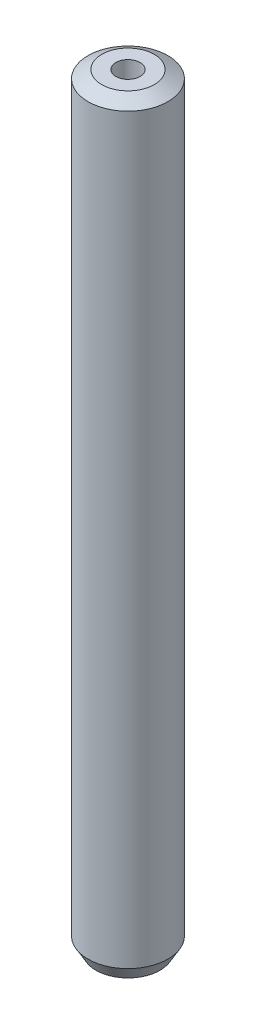
ISO-10303-21;
HEADER;
FILE_DESCRIPTION(('STEP AP214'),'2;1');
FILE_NAME('part.step','',(''),(''),'','','');
FILE_SCHEMA(('AUTOMOTIVE_DESIGN { 1 0 10303 214 1 1 1 1 }'));
ENDSEC;
DATA;
#1=APPLICATION_CONTEXT('core data for automotive mechanical design processes');
#2=APPLICATION_PROTOCOL_DEFINITION('international standard','automotive_design',2000,#1);
#3=PRODUCT_CONTEXT('',#1,'mechanical');
#4=PRODUCT('Part','Part','',(#3));
#5=PRODUCT_RELATED_PRODUCT_CATEGORY('part','',(#4));
#6=PRODUCT_DEFINITION_FORMATION('','',#4);
#7=PRODUCT_DEFINITION_CONTEXT('part definition',#1,'design');
#8=PRODUCT_DEFINITION('design','',#6,#7);
#9=PRODUCT_DEFINITION_SHAPE('','',#8);
#10=(LENGTH_UNIT() NAMED_UNIT(*) SI_UNIT(.MILLI.,.METRE.));
#11=(NAMED_UNIT(*) PLANE_ANGLE_UNIT() SI_UNIT($,.RADIAN.));
#12=(NAMED_UNIT(*) SI_UNIT($,.STERADIAN.) SOLID_ANGLE_UNIT());
#13=UNCERTAINTY_MEASURE_WITH_UNIT(LENGTH_MEASURE(1.E-05),#10,'distance_accuracy_value','');
#14=(GEOMETRIC_REPRESENTATION_CONTEXT(3) GLOBAL_UNCERTAINTY_ASSIGNED_CONTEXT((#13)) GLOBAL_UNIT_ASSIGNED_CONTEXT((#10,
#11,#12)) REPRESENTATION_CONTEXT('',''));
#15=CARTESIAN_POINT('',(0.,0.,0.));
#16=DIRECTION('',(0.,0.,1.));
#17=DIRECTION('',(1.,0.,0.));
#18=AXIS2_PLACEMENT_3D('',#15,#16,#17);
#19=CARTESIAN_POINT('',(0.,526.149621222578,0.));
#20=DIRECTION('',(0.,-1.,0.));
#21=DIRECTION('',(0.,0.,-1.));
#22=AXIS2_PLACEMENT_3D('',#19,#20,#21);
#23=CYLINDRICAL_SURFACE('',#22,27.5);
#24=CARTESIAN_POINT('',(0.,520.702828045299,0.));
#25=DIRECTION('',(0.,1.,0.));
#26=DIRECTION('',(0.,0.,1.));
#27=AXIS2_PLACEMENT_3D('',#24,#25,#26);
#28=CIRCLE('',#27,27.5);
#29=CARTESIAN_POINT('',(0.,520.702828045299,27.5));
#30=VERTEX_POINT('',#29);
#31=EDGE_CURVE('E50',#30,#30,#28,.F.);
#32=ORIENTED_EDGE('',*,*,#31,.T.);
#33=EDGE_LOOP('',(#32));
#34=FACE_BOUND('',#33,.T.);
#35=CARTESIAN_POINT('',(0.,9.43412252136611,0.));
#36=DIRECTION('',(0.,1.,0.));
#37=DIRECTION('',(0.,0.,1.));
#38=AXIS2_PLACEMENT_3D('',#35,#36,#37);
#39=CIRCLE('',#38,27.5);
#40=CARTESIAN_POINT('',(0.,9.43412252136611,27.5));
#41=VERTEX_POINT('',#40);
#42=EDGE_CURVE('E51',#41,#41,#39,.T.);
#43=ORIENTED_EDGE('',*,*,#42,.T.);
#44=EDGE_LOOP('',(#43));
#45=FACE_BOUND('',#44,.T.);
#46=ADVANCED_FACE('F39',(#34,#45),#23,.T.);
#47=CARTESIAN_POINT('',(0.,526.149621222578,0.));
#48=DIRECTION('',(0.,1.,0.));
#49=DIRECTION('',(0.,0.,1.));
#50=AXIS2_PLACEMENT_3D('',#47,#48,#49);
#51=PLANE('',#50);
#52=CARTESIAN_POINT('',(0.,526.149621222578,0.));
#53=DIRECTION('',(0.,1.,0.));
#54=DIRECTION('',(0.,0.,1.));
#55=AXIS2_PLACEMENT_3D('',#52,#53,#54);
#56=CIRCLE('',#55,18.0658774786337);
#57=CARTESIAN_POINT('',(0.,526.149621222578,18.0658774786337));
#58=VERTEX_POINT('',#57);
#59=EDGE_CURVE('E54',#58,#58,#56,.T.);
#60=ORIENTED_EDGE('',*,*,#59,.T.);
#61=EDGE_LOOP('',(#60));
#62=FACE_BOUND('',#61,.T.);
#63=CARTESIAN_POINT('',(0.,526.149621222578,0.));
#64=DIRECTION('',(0.,1.,0.));
#65=DIRECTION('',(0.,0.,1.));
#66=AXIS2_PLACEMENT_3D('',#63,#64,#65);
#67=CIRCLE('',#66,8.35634382573577);
#68=CARTESIAN_POINT('',(0.,526.149621222578,8.35634382573577));
#69=VERTEX_POINT('',#68);
#70=EDGE_CURVE('E58',#69,#69,#67,.T.);
#71=ORIENTED_EDGE('',*,*,#70,.F.);
#72=EDGE_LOOP('',(#71));
#73=FACE_BOUND('',#72,.T.);
#74=ADVANCED_FACE('F69',(#62,#73),#51,.T.);
#75=CARTESIAN_POINT('',(0.,0.,0.));
#76=DIRECTION('',(0.,1.,0.));
#77=DIRECTION('',(0.,0.,1.));
#78=AXIS2_PLACEMENT_3D('',#75,#76,#77);
#79=PLANE('',#78);
#80=CARTESIAN_POINT('',(0.,0.,0.));
#81=DIRECTION('',(0.,1.,0.));
#82=DIRECTION('',(0.,0.,1.));
#83=AXIS2_PLACEMENT_3D('',#80,#81,#82);
#84=CIRCLE('',#83,22.0532068227213);
#85=CARTESIAN_POINT('',(0.,0.,22.0532068227213));
#86=VERTEX_POINT('',#85);
#87=EDGE_CURVE('E10',#86,#86,#84,.F.);
#88=ORIENTED_EDGE('',*,*,#87,.T.);
#89=EDGE_LOOP('',(#88));
#90=FACE_BOUND('',#89,.T.);
#91=CARTESIAN_POINT('',(0.,0.,0.));
#92=DIRECTION('',(0.,1.,0.));
#93=DIRECTION('',(0.,0.,1.));
#94=AXIS2_PLACEMENT_3D('',#91,#92,#93);
#95=CIRCLE('',#94,8.35634382573577);
#96=CARTESIAN_POINT('',(0.,0.,8.35634382573577));
#97=VERTEX_POINT('',#96);
#98=EDGE_CURVE('E63',#97,#97,#95,.T.);
#99=ORIENTED_EDGE('',*,*,#98,.T.);
#100=EDGE_LOOP('',(#99));
#101=FACE_BOUND('',#100,.T.);
#102=ADVANCED_FACE('F75',(#90,#101),#79,.F.);
#103=CARTESIAN_POINT('',(0.,526.149621222578,0.));
#104=DIRECTION('',(0.,-1.,0.));
#105=DIRECTION('',(0.,0.,-1.));
#106=AXIS2_PLACEMENT_3D('',#103,#104,#105);
#107=CYLINDRICAL_SURFACE('',#106,8.35634382573577);
#108=ORIENTED_EDGE('',*,*,#70,.T.);
#109=EDGE_LOOP('',(#108));
#110=FACE_BOUND('',#109,.T.);
#111=ORIENTED_EDGE('',*,*,#98,.F.);
#112=EDGE_LOOP('',(#111));
#113=FACE_BOUND('',#112,.T.);
#114=ADVANCED_FACE('F70',(#110,#113),#107,.F.);
#115=CARTESIAN_POINT('',(0.,526.149621222578,0.));
#116=DIRECTION('',(0.,-1.,0.));
#117=DIRECTION('',(0.,0.,-1.));
#118=AXIS2_PLACEMENT_3D('',#115,#116,#117);
#119=CONICAL_SURFACE('',#118,18.0658774786337,1.04719755119659);
#120=ORIENTED_EDGE('',*,*,#31,.F.);
#121=EDGE_LOOP('',(#120));
#122=FACE_BOUND('',#121,.T.);
#123=ORIENTED_EDGE('',*,*,#59,.F.);
#124=EDGE_LOOP('',(#123));
#125=FACE_BOUND('',#124,.T.);
#126=ADVANCED_FACE('F81',(#122,#125),#119,.T.);
#127=CARTESIAN_POINT('',(0.,9.43412252136611,0.));
#128=DIRECTION('',(0.,1.,0.));
#129=DIRECTION('',(0.,0.,1.));
#130=AXIS2_PLACEMENT_3D('',#127,#128,#129);
#131=CONICAL_SURFACE('',#130,27.5,0.523598775598302);
#132=ORIENTED_EDGE('',*,*,#87,.F.);
#133=EDGE_LOOP('',(#132));
#134=FACE_BOUND('',#133,.T.);
#135=ORIENTED_EDGE('',*,*,#42,.F.);
#136=EDGE_LOOP('',(#135));
#137=FACE_BOUND('',#136,.T.);
#138=ADVANCED_FACE('F45',(#134,#137),#131,.T.);
#139=CLOSED_SHELL('',(#46,#74,#102,#114,#126,#138));
#140=MANIFOLD_SOLID_BREP('B2',#139);
#141=ADVANCED_BREP_SHAPE_REPRESENTATION('',(#18,#140),#14);
#142=SHAPE_DEFINITION_REPRESENTATION(#9,#141);
ENDSEC;
END-ISO-10303-21;
